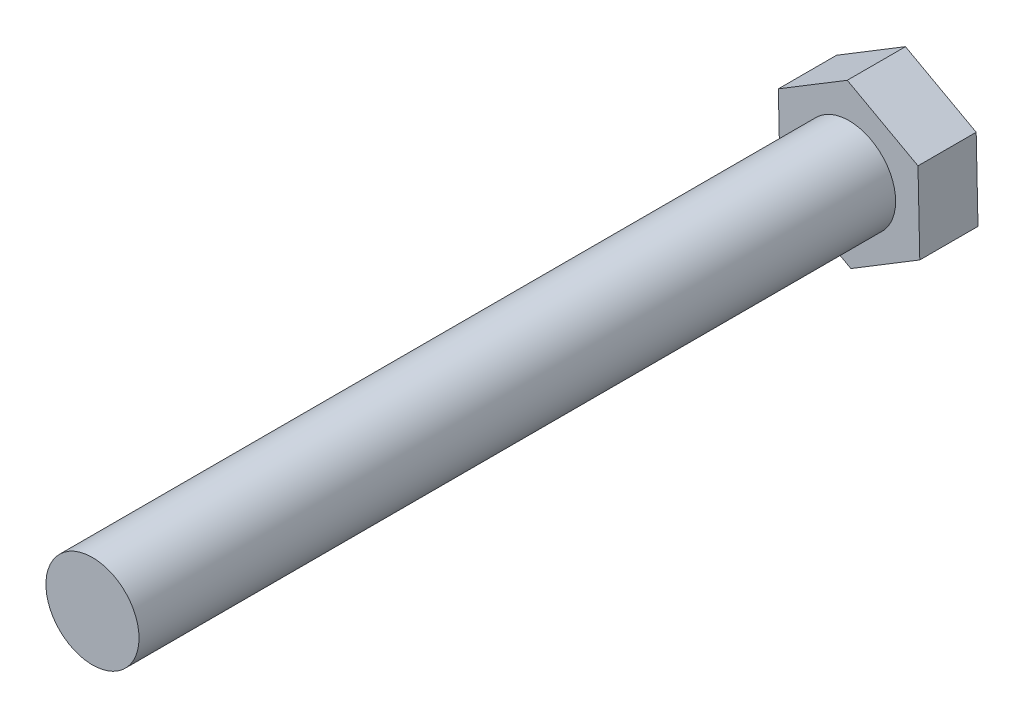
ISO-10303-21;
HEADER;
FILE_DESCRIPTION(('STEP AP214'),'2;1');
FILE_NAME('part.step','',(''),(''),'','','');
FILE_SCHEMA(('AUTOMOTIVE_DESIGN { 1 0 10303 214 1 1 1 1 }'));
ENDSEC;
DATA;
#1=APPLICATION_CONTEXT('core data for automotive mechanical design processes');
#2=APPLICATION_PROTOCOL_DEFINITION('international standard','automotive_design',2000,#1);
#3=PRODUCT_CONTEXT('',#1,'mechanical');
#4=PRODUCT('Part','Part','',(#3));
#5=PRODUCT_RELATED_PRODUCT_CATEGORY('part','',(#4));
#6=PRODUCT_DEFINITION_FORMATION('','',#4);
#7=PRODUCT_DEFINITION_CONTEXT('part definition',#1,'design');
#8=PRODUCT_DEFINITION('design','',#6,#7);
#9=PRODUCT_DEFINITION_SHAPE('','',#8);
#10=(LENGTH_UNIT() NAMED_UNIT(*) SI_UNIT(.MILLI.,.METRE.));
#11=(NAMED_UNIT(*) PLANE_ANGLE_UNIT() SI_UNIT($,.RADIAN.));
#12=(NAMED_UNIT(*) SI_UNIT($,.STERADIAN.) SOLID_ANGLE_UNIT());
#13=UNCERTAINTY_MEASURE_WITH_UNIT(LENGTH_MEASURE(1.E-05),#10,'distance_accuracy_value','');
#14=(GEOMETRIC_REPRESENTATION_CONTEXT(3) GLOBAL_UNCERTAINTY_ASSIGNED_CONTEXT((#13)) GLOBAL_UNIT_ASSIGNED_CONTEXT((#10,
#11,#12)) REPRESENTATION_CONTEXT('',''));
#15=CARTESIAN_POINT('',(0.,0.,0.));
#16=DIRECTION('',(0.,0.,1.));
#17=DIRECTION('',(1.,0.,0.));
#18=AXIS2_PLACEMENT_3D('',#15,#16,#17);
#19=CARTESIAN_POINT('',(0.,0.,-65.));
#20=DIRECTION('',(0.,0.,1.));
#21=DIRECTION('',(-1.,0.,0.));
#22=AXIS2_PLACEMENT_3D('',#19,#20,#21);
#23=CYLINDRICAL_SURFACE('',#22,4.);
#24=CARTESIAN_POINT('',(0.,0.,-65.));
#25=DIRECTION('',(0.,0.,1.));
#26=DIRECTION('',(1.,0.,0.));
#27=AXIS2_PLACEMENT_3D('',#24,#25,#26);
#28=CIRCLE('',#27,4.);
#29=CARTESIAN_POINT('',(4.,0.,-65.));
#30=VERTEX_POINT('',#29);
#31=EDGE_CURVE('E11',#30,#30,#28,.T.);
#32=ORIENTED_EDGE('',*,*,#31,.T.);
#33=EDGE_LOOP('',(#32));
#34=FACE_BOUND('',#33,.T.);
#35=CARTESIAN_POINT('',(0.,0.,0.));
#36=DIRECTION('',(0.,0.,1.));
#37=DIRECTION('',(1.,0.,0.));
#38=AXIS2_PLACEMENT_3D('',#35,#36,#37);
#39=CIRCLE('',#38,4.);
#40=CARTESIAN_POINT('',(4.,0.,0.));
#41=VERTEX_POINT('',#40);
#42=EDGE_CURVE('E36',#41,#41,#39,.T.);
#43=ORIENTED_EDGE('',*,*,#42,.F.);
#44=EDGE_LOOP('',(#43));
#45=FACE_BOUND('',#44,.T.);
#46=ADVANCED_FACE('F33',(#34,#45),#23,.T.);
#47=CARTESIAN_POINT('',(0.,0.,0.));
#48=DIRECTION('',(0.,0.,-1.));
#49=DIRECTION('',(1.,0.,0.));
#50=AXIS2_PLACEMENT_3D('',#47,#48,#49);
#51=PLANE('',#50);
#52=ORIENTED_EDGE('',*,*,#42,.T.);
#53=EDGE_LOOP('',(#52));
#54=FACE_BOUND('',#53,.T.);
#55=ADVANCED_FACE('F143',(#54),#51,.F.);
#56=CARTESIAN_POINT('',(0.155789851531613,-6.92645143794141,-70.));
#57=DIRECTION('',(-0.519347306719483,0.854563265652824,0.));
#58=DIRECTION('',(-0.854563265652824,-0.519347306719483,0.));
#59=AXIS2_PLACEMENT_3D('',#56,#57,#58);
#60=PLANE('',#59);
#61=DIRECTION('',(0.854563265652824,0.519347306719483,0.));
#62=VECTOR('',#61,1.);
#63=CARTESIAN_POINT('',(0.155789851531613,-6.92645143794141,-65.));
#64=LINE('',#63,#62);
#65=CARTESIAN_POINT('',(0.155789851531613,-6.92645143794141,-65.));
#66=VERTEX_POINT('',#65);
#67=CARTESIAN_POINT('',(6.07637782910223,-3.32830774989254,-65.));
#68=VERTEX_POINT('',#67);
#69=EDGE_CURVE('E116',#66,#68,#64,.T.);
#70=ORIENTED_EDGE('',*,*,#69,.F.);
#71=DIRECTION('',(0.,0.,1.));
#72=VECTOR('',#71,1.);
#73=CARTESIAN_POINT('',(0.155789851531613,-6.92645143794141,-70.));
#74=LINE('',#73,#72);
#75=CARTESIAN_POINT('',(0.155789851531613,-6.92645143794141,-70.));
#76=VERTEX_POINT('',#75);
#77=EDGE_CURVE('E115',#76,#66,#74,.T.);
#78=ORIENTED_EDGE('',*,*,#77,.F.);
#79=DIRECTION('',(0.854563265652824,0.519347306719483,0.));
#80=VECTOR('',#79,1.);
#81=CARTESIAN_POINT('',(0.155789851531613,-6.92645143794141,-70.));
#82=LINE('',#81,#80);
#83=CARTESIAN_POINT('',(6.07637782910223,-3.32830774989254,-70.));
#84=VERTEX_POINT('',#83);
#85=EDGE_CURVE('E128',#76,#84,#82,.T.);
#86=ORIENTED_EDGE('',*,*,#85,.T.);
#87=DIRECTION('',(0.,0.,1.));
#88=VECTOR('',#87,1.);
#89=CARTESIAN_POINT('',(6.07637782910223,-3.32830774989254,-70.));
#90=LINE('',#89,#88);
#91=EDGE_CURVE('E135',#84,#68,#90,.T.);
#92=ORIENTED_EDGE('',*,*,#91,.T.);
#93=EDGE_LOOP('',(#70,#78,#86,#92));
#94=FACE_BOUND('',#93,.T.);
#95=ADVANCED_FACE('F150',(#94),#60,.F.);
#96=CARTESIAN_POINT('',(6.07637782910223,-3.32830774989254,-70.));
#97=DIRECTION('',(-0.999747150556077,-0.0224863281796888,0.));
#98=DIRECTION('',(0.0224863281796888,-0.999747150556077,0.));
#99=AXIS2_PLACEMENT_3D('',#96,#97,#98);
#100=PLANE('',#99);
#101=DIRECTION('',(-0.0224863281796888,0.999747150556077,0.));
#102=VECTOR('',#101,1.);
#103=CARTESIAN_POINT('',(6.07637782910223,-3.32830774989254,-65.));
#104=LINE('',#103,#102);
#105=CARTESIAN_POINT('',(5.92058797757067,3.59814368804881,-65.));
#106=VERTEX_POINT('',#105);
#107=EDGE_CURVE('E118',#68,#106,#104,.T.);
#108=ORIENTED_EDGE('',*,*,#107,.F.);
#109=ORIENTED_EDGE('',*,*,#91,.F.);
#110=DIRECTION('',(-0.0224863281796888,0.999747150556077,0.));
#111=VECTOR('',#110,1.);
#112=CARTESIAN_POINT('',(6.07637782910223,-3.32830774989254,-70.));
#113=LINE('',#112,#111);
#114=CARTESIAN_POINT('',(5.92058797757067,3.59814368804881,-70.));
#115=VERTEX_POINT('',#114);
#116=EDGE_CURVE('E81',#84,#115,#113,.T.);
#117=ORIENTED_EDGE('',*,*,#116,.T.);
#118=DIRECTION('',(0.,0.,1.));
#119=VECTOR('',#118,1.);
#120=CARTESIAN_POINT('',(5.92058797757067,3.59814368804881,-70.));
#121=LINE('',#120,#119);
#122=EDGE_CURVE('E132',#115,#106,#121,.T.);
#123=ORIENTED_EDGE('',*,*,#122,.T.);
#124=EDGE_LOOP('',(#108,#109,#117,#123));
#125=FACE_BOUND('',#124,.T.);
#126=ADVANCED_FACE('F172',(#125),#100,.F.);
#127=CARTESIAN_POINT('',(5.92058797757067,3.59814368804881,-70.));
#128=DIRECTION('',(-0.480399843836594,-0.877049593832513,0.));
#129=DIRECTION('',(0.877049593832513,-0.480399843836594,0.));
#130=AXIS2_PLACEMENT_3D('',#127,#128,#129);
#131=PLANE('',#130);
#132=DIRECTION('',(-0.877049593832513,0.480399843836594,0.));
#133=VECTOR('',#132,1.);
#134=CARTESIAN_POINT('',(5.92058797757067,3.59814368804881,-65.));
#135=LINE('',#134,#133);
#136=CARTESIAN_POINT('',(-0.155789851531557,6.92645143794135,-65.));
#137=VERTEX_POINT('',#136);
#138=EDGE_CURVE('E121',#106,#137,#135,.T.);
#139=ORIENTED_EDGE('',*,*,#138,.F.);
#140=ORIENTED_EDGE('',*,*,#122,.F.);
#141=DIRECTION('',(-0.877049593832513,0.480399843836594,0.));
#142=VECTOR('',#141,1.);
#143=CARTESIAN_POINT('',(5.92058797757067,3.59814368804881,-70.));
#144=LINE('',#143,#142);
#145=CARTESIAN_POINT('',(-0.155789851531557,6.92645143794135,-70.));
#146=VERTEX_POINT('',#145);
#147=EDGE_CURVE('E109',#115,#146,#144,.T.);
#148=ORIENTED_EDGE('',*,*,#147,.T.);
#149=DIRECTION('',(0.,0.,1.));
#150=VECTOR('',#149,1.);
#151=CARTESIAN_POINT('',(-0.155789851531557,6.92645143794135,-70.));
#152=LINE('',#151,#150);
#153=EDGE_CURVE('E103',#146,#137,#152,.T.);
#154=ORIENTED_EDGE('',*,*,#153,.T.);
#155=EDGE_LOOP('',(#139,#140,#148,#154));
#156=FACE_BOUND('',#155,.T.);
#157=ADVANCED_FACE('F169',(#156),#131,.F.);
#158=CARTESIAN_POINT('',(-0.155789851531557,6.92645143794135,-70.));
#159=DIRECTION('',(0.519347306719483,-0.854563265652824,0.));
#160=DIRECTION('',(0.854563265652824,0.519347306719483,0.));
#161=AXIS2_PLACEMENT_3D('',#158,#159,#160);
#162=PLANE('',#161);
#163=DIRECTION('',(-0.854563265652824,-0.519347306719483,0.));
#164=VECTOR('',#163,1.);
#165=CARTESIAN_POINT('',(-0.155789851531557,6.92645143794135,-65.));
#166=LINE('',#165,#164);
#167=CARTESIAN_POINT('',(-6.07637782910225,3.32830774989254,-65.));
#168=VERTEX_POINT('',#167);
#169=EDGE_CURVE('E124',#137,#168,#166,.T.);
#170=ORIENTED_EDGE('',*,*,#169,.F.);
#171=ORIENTED_EDGE('',*,*,#153,.F.);
#172=DIRECTION('',(-0.854563265652824,-0.519347306719483,0.));
#173=VECTOR('',#172,1.);
#174=CARTESIAN_POINT('',(-0.155789851531557,6.92645143794135,-70.));
#175=LINE('',#174,#173);
#176=CARTESIAN_POINT('',(-6.07637782910225,3.32830774989254,-70.));
#177=VERTEX_POINT('',#176);
#178=EDGE_CURVE('E93',#146,#177,#175,.T.);
#179=ORIENTED_EDGE('',*,*,#178,.T.);
#180=DIRECTION('',(0.,0.,1.));
#181=VECTOR('',#180,1.);
#182=CARTESIAN_POINT('',(-6.07637782910225,3.32830774989254,-70.));
#183=LINE('',#182,#181);
#184=EDGE_CURVE('E98',#177,#168,#183,.T.);
#185=ORIENTED_EDGE('',*,*,#184,.T.);
#186=EDGE_LOOP('',(#170,#171,#179,#185));
#187=FACE_BOUND('',#186,.T.);
#188=ADVANCED_FACE('F106',(#187),#162,.F.);
#189=CARTESIAN_POINT('',(-6.07637782910225,3.32830774989254,-70.));
#190=DIRECTION('',(0.999747150556077,0.0224863281796886,0.));
#191=DIRECTION('',(-0.0224863281796886,0.999747150556077,0.));
#192=AXIS2_PLACEMENT_3D('',#189,#190,#191);
#193=PLANE('',#192);
#194=DIRECTION('',(0.0224863281796886,-0.999747150556077,0.));
#195=VECTOR('',#194,1.);
#196=CARTESIAN_POINT('',(-6.07637782910225,3.32830774989254,-65.));
#197=LINE('',#196,#195);
#198=CARTESIAN_POINT('',(-5.92058797757064,-3.59814368804884,-65.));
#199=VERTEX_POINT('',#198);
#200=EDGE_CURVE('E100',#168,#199,#197,.T.);
#201=ORIENTED_EDGE('',*,*,#200,.F.);
#202=ORIENTED_EDGE('',*,*,#184,.F.);
#203=DIRECTION('',(0.0224863281796886,-0.999747150556077,0.));
#204=VECTOR('',#203,1.);
#205=CARTESIAN_POINT('',(-6.07637782910225,3.32830774989254,-70.));
#206=LINE('',#205,#204);
#207=CARTESIAN_POINT('',(-5.92058797757064,-3.59814368804884,-70.));
#208=VERTEX_POINT('',#207);
#209=EDGE_CURVE('E89',#177,#208,#206,.T.);
#210=ORIENTED_EDGE('',*,*,#209,.T.);
#211=DIRECTION('',(0.,0.,1.));
#212=VECTOR('',#211,1.);
#213=CARTESIAN_POINT('',(-5.92058797757064,-3.59814368804884,-70.));
#214=LINE('',#213,#212);
#215=EDGE_CURVE('E104',#208,#199,#214,.T.);
#216=ORIENTED_EDGE('',*,*,#215,.T.);
#217=EDGE_LOOP('',(#201,#202,#210,#216));
#218=FACE_BOUND('',#217,.T.);
#219=ADVANCED_FACE('F99',(#218),#193,.F.);
#220=CARTESIAN_POINT('',(-5.92058797757064,-3.59814368804884,-70.));
#221=DIRECTION('',(0.480399843836594,0.877049593832513,0.));
#222=DIRECTION('',(-0.877049593832513,0.480399843836595,0.));
#223=AXIS2_PLACEMENT_3D('',#220,#221,#222);
#224=PLANE('',#223);
#225=DIRECTION('',(0.877049593832513,-0.480399843836594,0.));
#226=VECTOR('',#225,1.);
#227=CARTESIAN_POINT('',(-5.92058797757064,-3.59814368804884,-65.));
#228=LINE('',#227,#226);
#229=EDGE_CURVE('E69',#199,#66,#228,.T.);
#230=ORIENTED_EDGE('',*,*,#229,.F.);
#231=ORIENTED_EDGE('',*,*,#215,.F.);
#232=DIRECTION('',(0.877049593832513,-0.480399843836594,0.));
#233=VECTOR('',#232,1.);
#234=CARTESIAN_POINT('',(-5.92058797757064,-3.59814368804884,-70.));
#235=LINE('',#234,#233);
#236=EDGE_CURVE('E49',#208,#76,#235,.T.);
#237=ORIENTED_EDGE('',*,*,#236,.T.);
#238=ORIENTED_EDGE('',*,*,#77,.T.);
#239=EDGE_LOOP('',(#230,#231,#237,#238));
#240=FACE_BOUND('',#239,.T.);
#241=ADVANCED_FACE('F157',(#240),#224,.F.);
#242=CARTESIAN_POINT('',(0.,0.,-70.));
#243=DIRECTION('',(0.,0.,-1.));
#244=DIRECTION('',(1.,0.,0.));
#245=AXIS2_PLACEMENT_3D('',#242,#243,#244);
#246=PLANE('',#245);
#247=ORIENTED_EDGE('',*,*,#85,.F.);
#248=ORIENTED_EDGE('',*,*,#236,.F.);
#249=ORIENTED_EDGE('',*,*,#209,.F.);
#250=ORIENTED_EDGE('',*,*,#178,.F.);
#251=ORIENTED_EDGE('',*,*,#147,.F.);
#252=ORIENTED_EDGE('',*,*,#116,.F.);
#253=EDGE_LOOP('',(#247,#248,#249,#250,#251,#252));
#254=FACE_BOUND('',#253,.T.);
#255=ADVANCED_FACE('F91',(#254),#246,.T.);
#256=CARTESIAN_POINT('',(0.,0.,-65.));
#257=DIRECTION('',(0.,0.,-1.));
#258=DIRECTION('',(1.,0.,0.));
#259=AXIS2_PLACEMENT_3D('',#256,#257,#258);
#260=PLANE('',#259);
#261=ORIENTED_EDGE('',*,*,#31,.F.);
#262=EDGE_LOOP('',(#261));
#263=FACE_BOUND('',#262,.T.);
#264=ORIENTED_EDGE('',*,*,#69,.T.);
#265=ORIENTED_EDGE('',*,*,#107,.T.);
#266=ORIENTED_EDGE('',*,*,#138,.T.);
#267=ORIENTED_EDGE('',*,*,#169,.T.);
#268=ORIENTED_EDGE('',*,*,#200,.T.);
#269=ORIENTED_EDGE('',*,*,#229,.T.);
#270=EDGE_LOOP('',(#264,#265,#266,#267,#268,#269));
#271=FACE_BOUND('',#270,.T.);
#272=ADVANCED_FACE('F153',(#263,#271),#260,.F.);
#273=CLOSED_SHELL('',(#46,#55,#95,#126,#157,#188,#219,#241,#255,#272));
#274=MANIFOLD_SOLID_BREP('B2',#273);
#275=ADVANCED_BREP_SHAPE_REPRESENTATION('',(#18,#274),#14);
#276=SHAPE_DEFINITION_REPRESENTATION(#9,#275);
ENDSEC;
END-ISO-10303-21;
